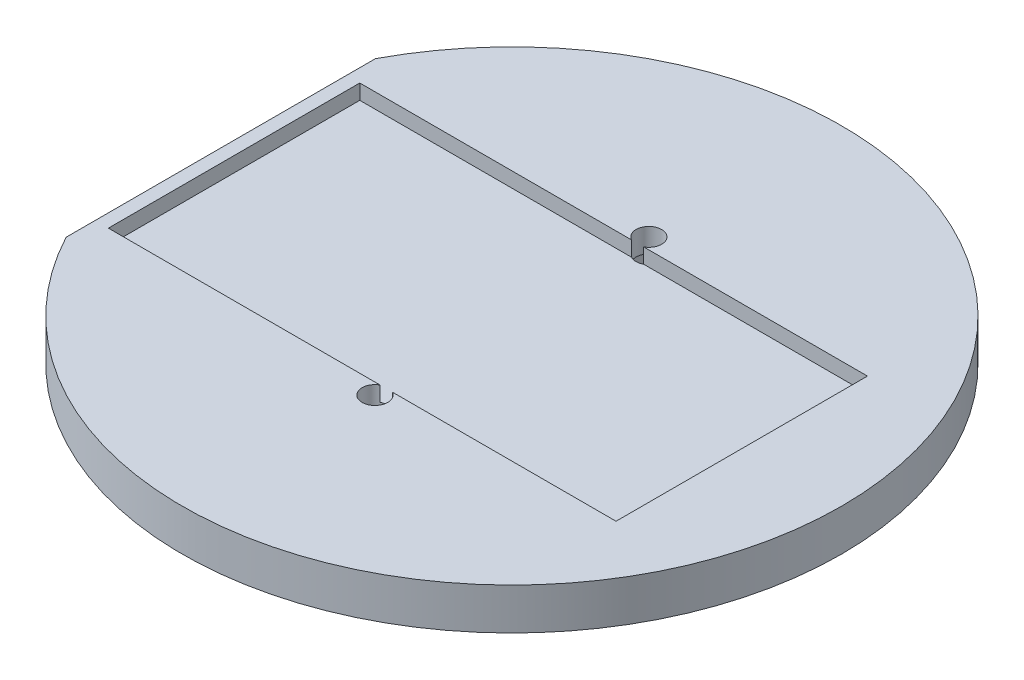
ISO-10303-21;
HEADER;
FILE_DESCRIPTION(('STEP AP214'),'2;1');
FILE_NAME('part.step','',(''),(''),'','','');
FILE_SCHEMA(('AUTOMOTIVE_DESIGN { 1 0 10303 214 1 1 1 1 }'));
ENDSEC;
DATA;
#1=APPLICATION_CONTEXT('core data for automotive mechanical design processes');
#2=APPLICATION_PROTOCOL_DEFINITION('international standard','automotive_design',2000,#1);
#3=PRODUCT_CONTEXT('',#1,'mechanical');
#4=PRODUCT('Part','Part','',(#3));
#5=PRODUCT_RELATED_PRODUCT_CATEGORY('part','',(#4));
#6=PRODUCT_DEFINITION_FORMATION('','',#4);
#7=PRODUCT_DEFINITION_CONTEXT('part definition',#1,'design');
#8=PRODUCT_DEFINITION('design','',#6,#7);
#9=PRODUCT_DEFINITION_SHAPE('','',#8);
#10=(LENGTH_UNIT() NAMED_UNIT(*) SI_UNIT(.MILLI.,.METRE.));
#11=(NAMED_UNIT(*) PLANE_ANGLE_UNIT() SI_UNIT($,.RADIAN.));
#12=(NAMED_UNIT(*) SI_UNIT($,.STERADIAN.) SOLID_ANGLE_UNIT());
#13=UNCERTAINTY_MEASURE_WITH_UNIT(LENGTH_MEASURE(1.E-05),#10,'distance_accuracy_value','');
#14=(GEOMETRIC_REPRESENTATION_CONTEXT(3) GLOBAL_UNCERTAINTY_ASSIGNED_CONTEXT((#13)) GLOBAL_UNIT_ASSIGNED_CONTEXT((#10,
#11,#12)) REPRESENTATION_CONTEXT('',''));
#15=CARTESIAN_POINT('',(0.,0.,0.));
#16=DIRECTION('',(0.,0.,1.));
#17=DIRECTION('',(1.,0.,0.));
#18=AXIS2_PLACEMENT_3D('',#15,#16,#17);
#19=CARTESIAN_POINT('',(0.,0.,0.));
#20=DIRECTION('',(0.,1.,0.));
#21=DIRECTION('',(0.,0.,1.));
#22=AXIS2_PLACEMENT_3D('',#19,#20,#21);
#23=PLANE('',#22);
#24=DIRECTION('',(0.,0.,1.));
#25=VECTOR('',#24,1.);
#26=CARTESIAN_POINT('',(-32.9399453551459,0.,0.));
#27=LINE('',#26,#25);
#28=CARTESIAN_POINT('',(-32.9399453551459,0.,-17.5));
#29=VERTEX_POINT('',#28);
#30=CARTESIAN_POINT('',(-32.9399453551459,0.,17.5));
#31=VERTEX_POINT('',#30);
#32=EDGE_CURVE('E414',#29,#31,#27,.T.);
#33=ORIENTED_EDGE('',*,*,#32,.F.);
#34=CARTESIAN_POINT('',(0.,0.,0.));
#35=DIRECTION('',(0.,1.,0.));
#36=DIRECTION('',(0.,0.,1.));
#37=AXIS2_PLACEMENT_3D('',#34,#35,#36);
#38=CIRCLE('',#37,37.3);
#39=EDGE_CURVE('E418',#31,#29,#38,.T.);
#40=ORIENTED_EDGE('',*,*,#39,.F.);
#41=EDGE_LOOP('',(#33,#40));
#42=FACE_BOUND('',#41,.T.);
#43=DIRECTION('',(-0.5,0.,0.866025403784438));
#44=VECTOR('',#43,1.);
#45=CARTESIAN_POINT('',(2.88675134594813,0.,-15.5));
#46=LINE('',#45,#44);
#47=CARTESIAN_POINT('',(2.88675134594813,0.,-15.5));
#48=VERTEX_POINT('',#47);
#49=CARTESIAN_POINT('',(1.44337567297406,0.,-13.));
#50=VERTEX_POINT('',#49);
#51=EDGE_CURVE('E311',#48,#50,#46,.T.);
#52=ORIENTED_EDGE('',*,*,#51,.F.);
#53=DIRECTION('',(0.5,0.,0.866025403784439));
#54=VECTOR('',#53,1.);
#55=CARTESIAN_POINT('',(1.44337567297407,0.,-18.));
#56=LINE('',#55,#54);
#57=CARTESIAN_POINT('',(1.44337567297407,0.,-18.));
#58=VERTEX_POINT('',#57);
#59=EDGE_CURVE('E282',#58,#48,#56,.T.);
#60=ORIENTED_EDGE('',*,*,#59,.F.);
#61=DIRECTION('',(1.,0.,0.));
#62=VECTOR('',#61,1.);
#63=CARTESIAN_POINT('',(-1.44337567297406,0.,-18.));
#64=LINE('',#63,#62);
#65=CARTESIAN_POINT('',(-1.44337567297406,0.,-18.));
#66=VERTEX_POINT('',#65);
#67=EDGE_CURVE('E288',#66,#58,#64,.T.);
#68=ORIENTED_EDGE('',*,*,#67,.F.);
#69=DIRECTION('',(0.5,0.,-0.866025403784439));
#70=VECTOR('',#69,1.);
#71=CARTESIAN_POINT('',(-2.88675134594813,0.,-15.5));
#72=LINE('',#71,#70);
#73=CARTESIAN_POINT('',(-2.88675134594813,0.,-15.5));
#74=VERTEX_POINT('',#73);
#75=EDGE_CURVE('E323',#74,#66,#72,.T.);
#76=ORIENTED_EDGE('',*,*,#75,.F.);
#77=DIRECTION('',(-0.5,0.,-0.866025403784439));
#78=VECTOR('',#77,1.);
#79=CARTESIAN_POINT('',(-1.44337567297406,0.,-13.));
#80=LINE('',#79,#78);
#81=CARTESIAN_POINT('',(-1.44337567297406,0.,-13.));
#82=VERTEX_POINT('',#81);
#83=EDGE_CURVE('E319',#82,#74,#80,.T.);
#84=ORIENTED_EDGE('',*,*,#83,.F.);
#85=DIRECTION('',(-1.,0.,0.));
#86=VECTOR('',#85,1.);
#87=CARTESIAN_POINT('',(1.44337567297406,0.,-13.));
#88=LINE('',#87,#86);
#89=EDGE_CURVE('E315',#50,#82,#88,.T.);
#90=ORIENTED_EDGE('',*,*,#89,.F.);
#91=EDGE_LOOP('',(#52,#60,#68,#76,#84,#90));
#92=FACE_BOUND('',#91,.T.);
#93=DIRECTION('',(0.5,0.,-0.866025403784439));
#94=VECTOR('',#93,1.);
#95=CARTESIAN_POINT('',(1.44337567297407,0.,18.));
#96=LINE('',#95,#94);
#97=CARTESIAN_POINT('',(1.44337567297407,0.,18.));
#98=VERTEX_POINT('',#97);
#99=CARTESIAN_POINT('',(2.88675134594813,0.,15.5));
#100=VERTEX_POINT('',#99);
#101=EDGE_CURVE('E65',#98,#100,#96,.T.);
#102=ORIENTED_EDGE('',*,*,#101,.T.);
#103=DIRECTION('',(-0.5,0.,-0.866025403784438));
#104=VECTOR('',#103,1.);
#105=CARTESIAN_POINT('',(2.88675134594813,0.,15.5));
#106=LINE('',#105,#104);
#107=CARTESIAN_POINT('',(1.44337567297406,0.,13.));
#108=VERTEX_POINT('',#107);
#109=EDGE_CURVE('E222',#100,#108,#106,.T.);
#110=ORIENTED_EDGE('',*,*,#109,.T.);
#111=DIRECTION('',(-1.,0.,0.));
#112=VECTOR('',#111,1.);
#113=CARTESIAN_POINT('',(1.44337567297406,0.,13.));
#114=LINE('',#113,#112);
#115=CARTESIAN_POINT('',(-1.44337567297406,0.,13.));
#116=VERTEX_POINT('',#115);
#117=EDGE_CURVE('E229',#108,#116,#114,.T.);
#118=ORIENTED_EDGE('',*,*,#117,.T.);
#119=DIRECTION('',(-0.5,0.,0.866025403784439));
#120=VECTOR('',#119,1.);
#121=CARTESIAN_POINT('',(-1.44337567297406,0.,13.));
#122=LINE('',#121,#120);
#123=CARTESIAN_POINT('',(-2.88675134594813,0.,15.5));
#124=VERTEX_POINT('',#123);
#125=EDGE_CURVE('E251',#116,#124,#122,.T.);
#126=ORIENTED_EDGE('',*,*,#125,.T.);
#127=DIRECTION('',(0.5,0.,0.866025403784439));
#128=VECTOR('',#127,1.);
#129=CARTESIAN_POINT('',(-2.88675134594813,0.,15.5));
#130=LINE('',#129,#128);
#131=CARTESIAN_POINT('',(-1.44337567297406,0.,18.));
#132=VERTEX_POINT('',#131);
#133=EDGE_CURVE('E247',#124,#132,#130,.T.);
#134=ORIENTED_EDGE('',*,*,#133,.T.);
#135=DIRECTION('',(1.,0.,0.));
#136=VECTOR('',#135,1.);
#137=CARTESIAN_POINT('',(-1.44337567297406,0.,18.));
#138=LINE('',#137,#136);
#139=EDGE_CURVE('E244',#132,#98,#138,.T.);
#140=ORIENTED_EDGE('',*,*,#139,.T.);
#141=EDGE_LOOP('',(#102,#110,#118,#126,#134,#140));
#142=FACE_BOUND('',#141,.T.);
#143=ADVANCED_FACE('F48',(#42,#92,#142),#23,.F.);
#144=CARTESIAN_POINT('',(0.,0.,15.5));
#145=DIRECTION('',(0.,1.,0.));
#146=DIRECTION('',(0.,0.,1.));
#147=AXIS2_PLACEMENT_3D('',#144,#145,#146);
#148=CYLINDRICAL_SURFACE('',#147,1.45);
#149=CARTESIAN_POINT('',(0.,4.7,15.5));
#150=DIRECTION('',(0.,-1.,0.));
#151=DIRECTION('',(0.,0.,-1.));
#152=AXIS2_PLACEMENT_3D('',#149,#150,#151);
#153=CIRCLE('',#152,1.45);
#154=CARTESIAN_POINT('',(0.690561365846656,4.7,14.225));
#155=VERTEX_POINT('',#154);
#156=CARTESIAN_POINT('',(-0.690561365846656,4.7,14.225));
#157=VERTEX_POINT('',#156);
#158=EDGE_CURVE('E272',#155,#157,#153,.T.);
#159=ORIENTED_EDGE('',*,*,#158,.F.);
#160=DIRECTION('',(0.,1.,0.));
#161=VECTOR('',#160,1.);
#162=CARTESIAN_POINT('',(0.690561365846656,0.,14.225));
#163=LINE('',#162,#161);
#164=CARTESIAN_POINT('',(0.690561365846656,3.,14.225));
#165=VERTEX_POINT('',#164);
#166=EDGE_CURVE('E73',#165,#155,#163,.T.);
#167=ORIENTED_EDGE('',*,*,#166,.F.);
#168=CARTESIAN_POINT('',(0.,3.,15.5));
#169=DIRECTION('',(0.,1.,0.));
#170=DIRECTION('',(0.,0.,1.));
#171=AXIS2_PLACEMENT_3D('',#168,#169,#170);
#172=CIRCLE('',#171,1.45);
#173=CARTESIAN_POINT('',(-0.690561365846656,3.,14.225));
#174=VERTEX_POINT('',#173);
#175=EDGE_CURVE('E11',#174,#165,#172,.F.);
#176=ORIENTED_EDGE('',*,*,#175,.F.);
#177=DIRECTION('',(0.,1.,0.));
#178=VECTOR('',#177,1.);
#179=CARTESIAN_POINT('',(-0.690561365846657,0.,14.225));
#180=LINE('',#179,#178);
#181=EDGE_CURVE('E278',#157,#174,#180,.F.);
#182=ORIENTED_EDGE('',*,*,#181,.F.);
#183=EDGE_LOOP('',(#159,#167,#176,#182));
#184=FACE_BOUND('',#183,.T.);
#185=CARTESIAN_POINT('',(0.,2.,15.5));
#186=DIRECTION('',(0.,-1.,0.));
#187=DIRECTION('',(0.,0.,-1.));
#188=AXIS2_PLACEMENT_3D('',#185,#186,#187);
#189=CIRCLE('',#188,1.45);
#190=CARTESIAN_POINT('',(0.,2.,14.05));
#191=VERTEX_POINT('',#190);
#192=EDGE_CURVE('E52',#191,#191,#189,.T.);
#193=ORIENTED_EDGE('',*,*,#192,.T.);
#194=EDGE_LOOP('',(#193));
#195=FACE_BOUND('',#194,.T.);
#196=ADVANCED_FACE('F457',(#184,#195),#148,.F.);
#197=CARTESIAN_POINT('',(26.0100546448541,4.7,14.225));
#198=DIRECTION('',(0.,0.,-1.));
#199=DIRECTION('',(-1.,0.,0.));
#200=AXIS2_PLACEMENT_3D('',#197,#198,#199);
#201=PLANE('',#200);
#202=DIRECTION('',(1.,0.,0.));
#203=VECTOR('',#202,1.);
#204=CARTESIAN_POINT('',(26.0100546448541,4.7,14.225));
#205=LINE('',#204,#203);
#206=CARTESIAN_POINT('',(-31.4399453551459,4.7,14.225));
#207=VERTEX_POINT('',#206);
#208=EDGE_CURVE('E364',#207,#157,#205,.T.);
#209=ORIENTED_EDGE('',*,*,#208,.T.);
#210=ORIENTED_EDGE('',*,*,#181,.T.);
#211=DIRECTION('',(1.,0.,0.));
#212=VECTOR('',#211,1.);
#213=CARTESIAN_POINT('',(26.0100546448541,3.,14.225));
#214=LINE('',#213,#212);
#215=CARTESIAN_POINT('',(-31.4399453551459,3.,14.225));
#216=VERTEX_POINT('',#215);
#217=EDGE_CURVE('E381',#216,#174,#214,.T.);
#218=ORIENTED_EDGE('',*,*,#217,.F.);
#219=DIRECTION('',(0.,-1.,0.));
#220=VECTOR('',#219,1.);
#221=CARTESIAN_POINT('',(-31.4399453551459,4.7,14.225));
#222=LINE('',#221,#220);
#223=EDGE_CURVE('E402',#207,#216,#222,.T.);
#224=ORIENTED_EDGE('',*,*,#223,.F.);
#225=EDGE_LOOP('',(#209,#210,#218,#224));
#226=FACE_BOUND('',#225,.T.);
#227=ADVANCED_FACE('F452',(#226),#201,.T.);
#228=CARTESIAN_POINT('',(26.0100546448541,3.,14.225));
#229=VERTEX_POINT('',#228);
#230=EDGE_CURVE('E380',#165,#229,#214,.T.);
#231=ORIENTED_EDGE('',*,*,#230,.F.);
#232=ORIENTED_EDGE('',*,*,#166,.T.);
#233=CARTESIAN_POINT('',(26.0100546448541,4.7,14.225));
#234=VERTEX_POINT('',#233);
#235=EDGE_CURVE('E362',#155,#234,#205,.T.);
#236=ORIENTED_EDGE('',*,*,#235,.T.);
#237=DIRECTION('',(0.,-1.,0.));
#238=VECTOR('',#237,1.);
#239=CARTESIAN_POINT('',(26.0100546448541,4.7,14.225));
#240=LINE('',#239,#238);
#241=EDGE_CURVE('E398',#234,#229,#240,.T.);
#242=ORIENTED_EDGE('',*,*,#241,.T.);
#243=EDGE_LOOP('',(#231,#232,#236,#242));
#244=FACE_BOUND('',#243,.T.);
#245=ADVANCED_FACE('F442',(#244),#201,.T.);
#246=CARTESIAN_POINT('',(0.,0.,-15.5));
#247=DIRECTION('',(0.,1.,0.));
#248=DIRECTION('',(0.,0.,1.));
#249=AXIS2_PLACEMENT_3D('',#246,#247,#248);
#250=CYLINDRICAL_SURFACE('',#249,1.45);
#251=DIRECTION('',(0.,1.,0.));
#252=VECTOR('',#251,1.);
#253=CARTESIAN_POINT('',(0.69056136584666,0.,-14.225));
#254=LINE('',#253,#252);
#255=CARTESIAN_POINT('',(0.690561365846659,3.,-14.225));
#256=VERTEX_POINT('',#255);
#257=CARTESIAN_POINT('',(0.690561365846659,4.7,-14.225));
#258=VERTEX_POINT('',#257);
#259=EDGE_CURVE('E355',#256,#258,#254,.T.);
#260=ORIENTED_EDGE('',*,*,#259,.T.);
#261=CARTESIAN_POINT('',(0.,4.7,-15.5));
#262=DIRECTION('',(0.,1.,0.));
#263=DIRECTION('',(0.,0.,1.));
#264=AXIS2_PLACEMENT_3D('',#261,#262,#263);
#265=CIRCLE('',#264,1.45);
#266=CARTESIAN_POINT('',(-0.690561365846659,4.7,-14.225));
#267=VERTEX_POINT('',#266);
#268=EDGE_CURVE('E349',#258,#267,#265,.T.);
#269=ORIENTED_EDGE('',*,*,#268,.T.);
#270=DIRECTION('',(0.,1.,0.));
#271=VECTOR('',#270,1.);
#272=CARTESIAN_POINT('',(-0.690561365846659,0.,-14.225));
#273=LINE('',#272,#271);
#274=CARTESIAN_POINT('',(-0.690561365846659,3.,-14.225));
#275=VERTEX_POINT('',#274);
#276=EDGE_CURVE('E352',#267,#275,#273,.F.);
#277=ORIENTED_EDGE('',*,*,#276,.T.);
#278=CARTESIAN_POINT('',(0.,3.,-15.5));
#279=DIRECTION('',(0.,1.,0.));
#280=DIRECTION('',(0.,0.,1.));
#281=AXIS2_PLACEMENT_3D('',#278,#279,#280);
#282=CIRCLE('',#281,1.45);
#283=EDGE_CURVE('E58',#275,#256,#282,.T.);
#284=ORIENTED_EDGE('',*,*,#283,.T.);
#285=EDGE_LOOP('',(#260,#269,#277,#284));
#286=FACE_BOUND('',#285,.T.);
#287=CARTESIAN_POINT('',(0.,2.,-15.5));
#288=DIRECTION('',(0.,-1.,0.));
#289=DIRECTION('',(0.,0.,-1.));
#290=AXIS2_PLACEMENT_3D('',#287,#288,#289);
#291=CIRCLE('',#290,1.45);
#292=CARTESIAN_POINT('',(0.,2.,-16.95));
#293=VERTEX_POINT('',#292);
#294=EDGE_CURVE('E333',#293,#293,#291,.F.);
#295=ORIENTED_EDGE('',*,*,#294,.F.);
#296=EDGE_LOOP('',(#295));
#297=FACE_BOUND('',#296,.T.);
#298=ADVANCED_FACE('F439',(#286,#297),#250,.F.);
#299=CARTESIAN_POINT('',(26.0100546448541,4.7,-14.225));
#300=DIRECTION('',(0.,0.,1.));
#301=DIRECTION('',(1.,0.,0.));
#302=AXIS2_PLACEMENT_3D('',#299,#300,#301);
#303=PLANE('',#302);
#304=ORIENTED_EDGE('',*,*,#259,.F.);
#305=DIRECTION('',(-1.,0.,0.));
#306=VECTOR('',#305,1.);
#307=CARTESIAN_POINT('',(26.0100546448541,3.,-14.225));
#308=LINE('',#307,#306);
#309=CARTESIAN_POINT('',(26.0100546448541,3.,-14.225));
#310=VERTEX_POINT('',#309);
#311=EDGE_CURVE('E363',#310,#256,#308,.T.);
#312=ORIENTED_EDGE('',*,*,#311,.F.);
#313=DIRECTION('',(0.,-1.,0.));
#314=VECTOR('',#313,1.);
#315=CARTESIAN_POINT('',(26.0100546448541,4.7,-14.225));
#316=LINE('',#315,#314);
#317=CARTESIAN_POINT('',(26.0100546448541,4.7,-14.225));
#318=VERTEX_POINT('',#317);
#319=EDGE_CURVE('E394',#318,#310,#316,.T.);
#320=ORIENTED_EDGE('',*,*,#319,.F.);
#321=DIRECTION('',(-1.,0.,0.));
#322=VECTOR('',#321,1.);
#323=CARTESIAN_POINT('',(26.0100546448541,4.7,-14.225));
#324=LINE('',#323,#322);
#325=EDGE_CURVE('E373',#318,#258,#324,.T.);
#326=ORIENTED_EDGE('',*,*,#325,.T.);
#327=EDGE_LOOP('',(#304,#312,#320,#326));
#328=FACE_BOUND('',#327,.T.);
#329=ADVANCED_FACE('F441',(#328),#303,.T.);
#330=CARTESIAN_POINT('',(-32.9399453551459,3.,0.));
#331=DIRECTION('',(1.,0.,0.));
#332=DIRECTION('',(0.,0.,-1.));
#333=AXIS2_PLACEMENT_3D('',#330,#331,#332);
#334=PLANE('',#333);
#335=ORIENTED_EDGE('',*,*,#32,.T.);
#336=DIRECTION('',(0.,-1.,0.));
#337=VECTOR('',#336,1.);
#338=CARTESIAN_POINT('',(-32.9399453551459,3.,17.5));
#339=LINE('',#338,#337);
#340=CARTESIAN_POINT('',(-32.9399453551459,4.7,17.5));
#341=VERTEX_POINT('',#340);
#342=EDGE_CURVE('E425',#341,#31,#339,.T.);
#343=ORIENTED_EDGE('',*,*,#342,.F.);
#344=DIRECTION('',(0.,0.,1.));
#345=VECTOR('',#344,1.);
#346=CARTESIAN_POINT('',(-32.9399453551459,4.7,-17.5));
#347=LINE('',#346,#345);
#348=CARTESIAN_POINT('',(-32.9399453551459,4.7,-17.5));
#349=VERTEX_POINT('',#348);
#350=EDGE_CURVE('E410',#349,#341,#347,.T.);
#351=ORIENTED_EDGE('',*,*,#350,.F.);
#352=DIRECTION('',(0.,-1.,0.));
#353=VECTOR('',#352,1.);
#354=CARTESIAN_POINT('',(-32.9399453551459,3.,-17.5));
#355=LINE('',#354,#353);
#356=EDGE_CURVE('E421',#349,#29,#355,.T.);
#357=ORIENTED_EDGE('',*,*,#356,.T.);
#358=EDGE_LOOP('',(#335,#343,#351,#357));
#359=FACE_BOUND('',#358,.T.);
#360=ADVANCED_FACE('F50',(#359),#334,.F.);
#361=CARTESIAN_POINT('',(0.,3.,0.));
#362=DIRECTION('',(0.,-1.,0.));
#363=DIRECTION('',(0.,0.,-1.));
#364=AXIS2_PLACEMENT_3D('',#361,#362,#363);
#365=CYLINDRICAL_SURFACE('',#364,37.3);
#366=ORIENTED_EDGE('',*,*,#39,.T.);
#367=ORIENTED_EDGE('',*,*,#356,.F.);
#368=CARTESIAN_POINT('',(0.,4.7,0.));
#369=DIRECTION('',(0.,1.,0.));
#370=DIRECTION('',(0.,0.,1.));
#371=AXIS2_PLACEMENT_3D('',#368,#369,#370);
#372=CIRCLE('',#371,37.3);
#373=EDGE_CURVE('E406',#341,#349,#372,.T.);
#374=ORIENTED_EDGE('',*,*,#373,.F.);
#375=ORIENTED_EDGE('',*,*,#342,.T.);
#376=EDGE_LOOP('',(#366,#367,#374,#375));
#377=FACE_BOUND('',#376,.T.);
#378=ADVANCED_FACE('F469',(#377),#365,.T.);
#379=CARTESIAN_POINT('',(0.,4.7,0.));
#380=DIRECTION('',(0.,1.,0.));
#381=DIRECTION('',(0.,0.,1.));
#382=AXIS2_PLACEMENT_3D('',#379,#380,#381);
#383=PLANE('',#382);
#384=ORIENTED_EDGE('',*,*,#235,.F.);
#385=ORIENTED_EDGE('',*,*,#158,.T.);
#386=ORIENTED_EDGE('',*,*,#208,.F.);
#387=DIRECTION('',(0.,0.,1.));
#388=VECTOR('',#387,1.);
#389=CARTESIAN_POINT('',(-31.4399453551459,4.7,14.225));
#390=LINE('',#389,#388);
#391=CARTESIAN_POINT('',(-31.4399453551459,4.7,-14.225));
#392=VERTEX_POINT('',#391);
#393=EDGE_CURVE('E359',#392,#207,#390,.T.);
#394=ORIENTED_EDGE('',*,*,#393,.F.);
#395=EDGE_CURVE('E372',#267,#392,#324,.T.);
#396=ORIENTED_EDGE('',*,*,#395,.F.);
#397=ORIENTED_EDGE('',*,*,#268,.F.);
#398=ORIENTED_EDGE('',*,*,#325,.F.);
#399=DIRECTION('',(0.,0.,-1.));
#400=VECTOR('',#399,1.);
#401=CARTESIAN_POINT('',(26.0100546448541,4.7,14.225));
#402=LINE('',#401,#400);
#403=EDGE_CURVE('E368',#234,#318,#402,.T.);
#404=ORIENTED_EDGE('',*,*,#403,.F.);
#405=EDGE_LOOP('',(#384,#385,#386,#394,#396,#397,#398,#404));
#406=FACE_BOUND('',#405,.T.);
#407=ORIENTED_EDGE('',*,*,#373,.T.);
#408=ORIENTED_EDGE('',*,*,#350,.T.);
#409=EDGE_LOOP('',(#407,#408));
#410=FACE_BOUND('',#409,.T.);
#411=ADVANCED_FACE('F471',(#406,#410),#383,.T.);
#412=CARTESIAN_POINT('',(-31.4399453551459,4.7,14.225));
#413=DIRECTION('',(1.,0.,0.));
#414=DIRECTION('',(0.,0.,-1.));
#415=AXIS2_PLACEMENT_3D('',#412,#413,#414);
#416=PLANE('',#415);
#417=DIRECTION('',(0.,0.,1.));
#418=VECTOR('',#417,1.);
#419=CARTESIAN_POINT('',(-31.4399453551459,3.,14.225));
#420=LINE('',#419,#418);
#421=CARTESIAN_POINT('',(-31.4399453551459,3.,-14.225));
#422=VERTEX_POINT('',#421);
#423=EDGE_CURVE('E358',#422,#216,#420,.T.);
#424=ORIENTED_EDGE('',*,*,#423,.F.);
#425=DIRECTION('',(0.,-1.,0.));
#426=VECTOR('',#425,1.);
#427=CARTESIAN_POINT('',(-31.4399453551459,4.7,-14.225));
#428=LINE('',#427,#426);
#429=EDGE_CURVE('E377',#392,#422,#428,.T.);
#430=ORIENTED_EDGE('',*,*,#429,.F.);
#431=ORIENTED_EDGE('',*,*,#393,.T.);
#432=ORIENTED_EDGE('',*,*,#223,.T.);
#433=EDGE_LOOP('',(#424,#430,#431,#432));
#434=FACE_BOUND('',#433,.T.);
#435=ADVANCED_FACE('F477',(#434),#416,.T.);
#436=CARTESIAN_POINT('',(26.0100546448541,4.7,14.225));
#437=DIRECTION('',(-1.,0.,0.));
#438=DIRECTION('',(0.,0.,1.));
#439=AXIS2_PLACEMENT_3D('',#436,#437,#438);
#440=PLANE('',#439);
#441=DIRECTION('',(0.,0.,-1.));
#442=VECTOR('',#441,1.);
#443=CARTESIAN_POINT('',(26.0100546448541,3.,14.225));
#444=LINE('',#443,#442);
#445=EDGE_CURVE('E385',#229,#310,#444,.T.);
#446=ORIENTED_EDGE('',*,*,#445,.F.);
#447=ORIENTED_EDGE('',*,*,#241,.F.);
#448=ORIENTED_EDGE('',*,*,#403,.T.);
#449=ORIENTED_EDGE('',*,*,#319,.T.);
#450=EDGE_LOOP('',(#446,#447,#448,#449));
#451=FACE_BOUND('',#450,.T.);
#452=ADVANCED_FACE('F610',(#451),#440,.T.);
#453=ORIENTED_EDGE('',*,*,#276,.F.);
#454=ORIENTED_EDGE('',*,*,#395,.T.);
#455=ORIENTED_EDGE('',*,*,#429,.T.);
#456=EDGE_CURVE('E388',#275,#422,#308,.T.);
#457=ORIENTED_EDGE('',*,*,#456,.F.);
#458=EDGE_LOOP('',(#453,#454,#455,#457));
#459=FACE_BOUND('',#458,.T.);
#460=ADVANCED_FACE('F451',(#459),#303,.T.);
#461=CARTESIAN_POINT('',(0.,3.,0.));
#462=DIRECTION('',(0.,1.,0.));
#463=DIRECTION('',(0.,0.,1.));
#464=AXIS2_PLACEMENT_3D('',#461,#462,#463);
#465=PLANE('',#464);
#466=ORIENTED_EDGE('',*,*,#217,.T.);
#467=ORIENTED_EDGE('',*,*,#175,.T.);
#468=ORIENTED_EDGE('',*,*,#230,.T.);
#469=ORIENTED_EDGE('',*,*,#445,.T.);
#470=ORIENTED_EDGE('',*,*,#311,.T.);
#471=ORIENTED_EDGE('',*,*,#283,.F.);
#472=ORIENTED_EDGE('',*,*,#456,.T.);
#473=ORIENTED_EDGE('',*,*,#423,.T.);
#474=EDGE_LOOP('',(#466,#467,#468,#469,#470,#471,#472,#473));
#475=FACE_BOUND('',#474,.T.);
#476=ADVANCED_FACE('F467',(#475),#465,.T.);
#477=CARTESIAN_POINT('',(0.,2.,0.));
#478=DIRECTION('',(0.,-1.,0.));
#479=DIRECTION('',(0.,0.,-1.));
#480=AXIS2_PLACEMENT_3D('',#477,#478,#479);
#481=PLANE('',#480);
#482=DIRECTION('',(0.5,0.,0.866025403784439));
#483=VECTOR('',#482,1.);
#484=CARTESIAN_POINT('',(1.44337567297407,2.,-18.));
#485=LINE('',#484,#483);
#486=CARTESIAN_POINT('',(1.44337567297407,2.,-18.));
#487=VERTEX_POINT('',#486);
#488=CARTESIAN_POINT('',(2.88675134594813,2.,-15.5));
#489=VERTEX_POINT('',#488);
#490=EDGE_CURVE('E283',#487,#489,#485,.T.);
#491=ORIENTED_EDGE('',*,*,#490,.T.);
#492=DIRECTION('',(-0.5,0.,0.866025403784438));
#493=VECTOR('',#492,1.);
#494=CARTESIAN_POINT('',(2.88675134594813,2.,-15.5));
#495=LINE('',#494,#493);
#496=CARTESIAN_POINT('',(1.44337567297406,2.,-13.));
#497=VERTEX_POINT('',#496);
#498=EDGE_CURVE('E287',#489,#497,#495,.T.);
#499=ORIENTED_EDGE('',*,*,#498,.T.);
#500=DIRECTION('',(-1.,0.,0.));
#501=VECTOR('',#500,1.);
#502=CARTESIAN_POINT('',(1.44337567297406,2.,-13.));
#503=LINE('',#502,#501);
#504=CARTESIAN_POINT('',(-1.44337567297406,2.,-13.));
#505=VERTEX_POINT('',#504);
#506=EDGE_CURVE('E292',#497,#505,#503,.T.);
#507=ORIENTED_EDGE('',*,*,#506,.T.);
#508=DIRECTION('',(-0.5,0.,-0.866025403784439));
#509=VECTOR('',#508,1.);
#510=CARTESIAN_POINT('',(-1.44337567297406,2.,-13.));
#511=LINE('',#510,#509);
#512=CARTESIAN_POINT('',(-2.88675134594813,2.,-15.5));
#513=VERTEX_POINT('',#512);
#514=EDGE_CURVE('E296',#505,#513,#511,.T.);
#515=ORIENTED_EDGE('',*,*,#514,.T.);
#516=DIRECTION('',(0.5,0.,-0.866025403784439));
#517=VECTOR('',#516,1.);
#518=CARTESIAN_POINT('',(-2.88675134594813,2.,-15.5));
#519=LINE('',#518,#517);
#520=CARTESIAN_POINT('',(-1.44337567297406,2.,-18.));
#521=VERTEX_POINT('',#520);
#522=EDGE_CURVE('E300',#513,#521,#519,.T.);
#523=ORIENTED_EDGE('',*,*,#522,.T.);
#524=DIRECTION('',(1.,0.,0.));
#525=VECTOR('',#524,1.);
#526=CARTESIAN_POINT('',(-1.44337567297406,2.,-18.));
#527=LINE('',#526,#525);
#528=EDGE_CURVE('E304',#521,#487,#527,.T.);
#529=ORIENTED_EDGE('',*,*,#528,.T.);
#530=EDGE_LOOP('',(#491,#499,#507,#515,#523,#529));
#531=FACE_BOUND('',#530,.T.);
#532=ORIENTED_EDGE('',*,*,#294,.T.);
#533=EDGE_LOOP('',(#532));
#534=FACE_BOUND('',#533,.T.);
#535=ADVANCED_FACE('F437',(#531,#534),#481,.T.);
#536=CARTESIAN_POINT('',(1.44337567297407,2.,-18.));
#537=DIRECTION('',(0.866025403784439,0.,-0.5));
#538=DIRECTION('',(-0.5,0.,-0.866025403784439));
#539=AXIS2_PLACEMENT_3D('',#536,#537,#538);
#540=PLANE('',#539);
#541=ORIENTED_EDGE('',*,*,#59,.T.);
#542=DIRECTION('',(0.,-1.,0.));
#543=VECTOR('',#542,1.);
#544=CARTESIAN_POINT('',(2.88675134594813,2.,-15.5));
#545=LINE('',#544,#543);
#546=EDGE_CURVE('E308',#489,#48,#545,.T.);
#547=ORIENTED_EDGE('',*,*,#546,.F.);
#548=ORIENTED_EDGE('',*,*,#490,.F.);
#549=DIRECTION('',(0.,-1.,0.));
#550=VECTOR('',#549,1.);
#551=CARTESIAN_POINT('',(1.44337567297407,2.,-18.));
#552=LINE('',#551,#550);
#553=EDGE_CURVE('E330',#487,#58,#552,.T.);
#554=ORIENTED_EDGE('',*,*,#553,.T.);
#555=EDGE_LOOP('',(#541,#547,#548,#554));
#556=FACE_BOUND('',#555,.T.);
#557=ADVANCED_FACE('F574',(#556),#540,.F.);
#558=CARTESIAN_POINT('',(-1.44337567297406,2.,-18.));
#559=DIRECTION('',(0.,0.,-1.));
#560=DIRECTION('',(-1.,0.,0.));
#561=AXIS2_PLACEMENT_3D('',#558,#559,#560);
#562=PLANE('',#561);
#563=ORIENTED_EDGE('',*,*,#67,.T.);
#564=ORIENTED_EDGE('',*,*,#553,.F.);
#565=ORIENTED_EDGE('',*,*,#528,.F.);
#566=DIRECTION('',(0.,-1.,0.));
#567=VECTOR('',#566,1.);
#568=CARTESIAN_POINT('',(-1.44337567297406,2.,-18.));
#569=LINE('',#568,#567);
#570=EDGE_CURVE('E334',#521,#66,#569,.T.);
#571=ORIENTED_EDGE('',*,*,#570,.T.);
#572=EDGE_LOOP('',(#563,#564,#565,#571));
#573=FACE_BOUND('',#572,.T.);
#574=ADVANCED_FACE('F563',(#573),#562,.F.);
#575=CARTESIAN_POINT('',(-2.88675134594813,2.,-15.5));
#576=DIRECTION('',(-0.866025403784439,0.,-0.5));
#577=DIRECTION('',(-0.5,0.,0.866025403784439));
#578=AXIS2_PLACEMENT_3D('',#575,#576,#577);
#579=PLANE('',#578);
#580=ORIENTED_EDGE('',*,*,#75,.T.);
#581=ORIENTED_EDGE('',*,*,#570,.F.);
#582=ORIENTED_EDGE('',*,*,#522,.F.);
#583=DIRECTION('',(0.,-1.,0.));
#584=VECTOR('',#583,1.);
#585=CARTESIAN_POINT('',(-2.88675134594813,2.,-15.5));
#586=LINE('',#585,#584);
#587=EDGE_CURVE('E337',#513,#74,#586,.T.);
#588=ORIENTED_EDGE('',*,*,#587,.T.);
#589=EDGE_LOOP('',(#580,#581,#582,#588));
#590=FACE_BOUND('',#589,.T.);
#591=ADVANCED_FACE('F552',(#590),#579,.F.);
#592=CARTESIAN_POINT('',(-1.44337567297406,2.,-13.));
#593=DIRECTION('',(-0.866025403784439,0.,0.5));
#594=DIRECTION('',(0.5,0.,0.866025403784439));
#595=AXIS2_PLACEMENT_3D('',#592,#593,#594);
#596=PLANE('',#595);
#597=ORIENTED_EDGE('',*,*,#83,.T.);
#598=ORIENTED_EDGE('',*,*,#587,.F.);
#599=ORIENTED_EDGE('',*,*,#514,.F.);
#600=DIRECTION('',(0.,-1.,0.));
#601=VECTOR('',#600,1.);
#602=CARTESIAN_POINT('',(-1.44337567297406,2.,-13.));
#603=LINE('',#602,#601);
#604=EDGE_CURVE('E340',#505,#82,#603,.T.);
#605=ORIENTED_EDGE('',*,*,#604,.T.);
#606=EDGE_LOOP('',(#597,#598,#599,#605));
#607=FACE_BOUND('',#606,.T.);
#608=ADVANCED_FACE('F541',(#607),#596,.F.);
#609=CARTESIAN_POINT('',(1.44337567297406,2.,-13.));
#610=DIRECTION('',(0.,0.,1.));
#611=DIRECTION('',(1.,0.,0.));
#612=AXIS2_PLACEMENT_3D('',#609,#610,#611);
#613=PLANE('',#612);
#614=ORIENTED_EDGE('',*,*,#89,.T.);
#615=ORIENTED_EDGE('',*,*,#604,.F.);
#616=ORIENTED_EDGE('',*,*,#506,.F.);
#617=DIRECTION('',(0.,-1.,0.));
#618=VECTOR('',#617,1.);
#619=CARTESIAN_POINT('',(1.44337567297406,2.,-13.));
#620=LINE('',#619,#618);
#621=EDGE_CURVE('E343',#497,#50,#620,.T.);
#622=ORIENTED_EDGE('',*,*,#621,.T.);
#623=EDGE_LOOP('',(#614,#615,#616,#622));
#624=FACE_BOUND('',#623,.T.);
#625=ADVANCED_FACE('F528',(#624),#613,.F.);
#626=CARTESIAN_POINT('',(2.88675134594813,2.,-15.5));
#627=DIRECTION('',(0.866025403784438,0.,0.5));
#628=DIRECTION('',(0.5,0.,-0.866025403784438));
#629=AXIS2_PLACEMENT_3D('',#626,#627,#628);
#630=PLANE('',#629);
#631=ORIENTED_EDGE('',*,*,#51,.T.);
#632=ORIENTED_EDGE('',*,*,#621,.F.);
#633=ORIENTED_EDGE('',*,*,#498,.F.);
#634=ORIENTED_EDGE('',*,*,#546,.T.);
#635=EDGE_LOOP('',(#631,#632,#633,#634));
#636=FACE_BOUND('',#635,.T.);
#637=ADVANCED_FACE('F522',(#636),#630,.F.);
#638=CARTESIAN_POINT('',(1.44337567297407,2.,18.));
#639=DIRECTION('',(-0.866025403784439,0.,-0.5));
#640=DIRECTION('',(-0.5,0.,0.866025403784439));
#641=AXIS2_PLACEMENT_3D('',#638,#639,#640);
#642=PLANE('',#641);
#643=ORIENTED_EDGE('',*,*,#101,.F.);
#644=DIRECTION('',(0.,-1.,0.));
#645=VECTOR('',#644,1.);
#646=CARTESIAN_POINT('',(1.44337567297407,2.,18.));
#647=LINE('',#646,#645);
#648=CARTESIAN_POINT('',(1.44337567297407,2.,18.));
#649=VERTEX_POINT('',#648);
#650=EDGE_CURVE('E203',#649,#98,#647,.T.);
#651=ORIENTED_EDGE('',*,*,#650,.F.);
#652=DIRECTION('',(0.5,0.,-0.866025403784439));
#653=VECTOR('',#652,1.);
#654=CARTESIAN_POINT('',(1.44337567297407,2.,18.));
#655=LINE('',#654,#653);
#656=CARTESIAN_POINT('',(2.88675134594813,2.,15.5));
#657=VERTEX_POINT('',#656);
#658=EDGE_CURVE('E211',#649,#657,#655,.T.);
#659=ORIENTED_EDGE('',*,*,#658,.T.);
#660=DIRECTION('',(0.,-1.,0.));
#661=VECTOR('',#660,1.);
#662=CARTESIAN_POINT('',(2.88675134594813,2.,15.5));
#663=LINE('',#662,#661);
#664=EDGE_CURVE('E258',#657,#100,#663,.T.);
#665=ORIENTED_EDGE('',*,*,#664,.T.);
#666=EDGE_LOOP('',(#643,#651,#659,#665));
#667=FACE_BOUND('',#666,.T.);
#668=ADVANCED_FACE('F214',(#667),#642,.T.);
#669=CARTESIAN_POINT('',(2.88675134594813,2.,15.5));
#670=DIRECTION('',(-0.866025403784438,0.,0.5));
#671=DIRECTION('',(0.5,0.,0.866025403784438));
#672=AXIS2_PLACEMENT_3D('',#669,#670,#671);
#673=PLANE('',#672);
#674=ORIENTED_EDGE('',*,*,#109,.F.);
#675=ORIENTED_EDGE('',*,*,#664,.F.);
#676=DIRECTION('',(-0.5,0.,-0.866025403784438));
#677=VECTOR('',#676,1.);
#678=CARTESIAN_POINT('',(2.88675134594813,2.,15.5));
#679=LINE('',#678,#677);
#680=CARTESIAN_POINT('',(1.44337567297406,2.,13.));
#681=VERTEX_POINT('',#680);
#682=EDGE_CURVE('E217',#657,#681,#679,.T.);
#683=ORIENTED_EDGE('',*,*,#682,.T.);
#684=DIRECTION('',(0.,-1.,0.));
#685=VECTOR('',#684,1.);
#686=CARTESIAN_POINT('',(1.44337567297406,2.,13.));
#687=LINE('',#686,#685);
#688=EDGE_CURVE('E261',#681,#108,#687,.T.);
#689=ORIENTED_EDGE('',*,*,#688,.T.);
#690=EDGE_LOOP('',(#674,#675,#683,#689));
#691=FACE_BOUND('',#690,.T.);
#692=ADVANCED_FACE('F704',(#691),#673,.T.);
#693=CARTESIAN_POINT('',(1.44337567297406,2.,13.));
#694=DIRECTION('',(0.,0.,1.));
#695=DIRECTION('',(1.,0.,0.));
#696=AXIS2_PLACEMENT_3D('',#693,#694,#695);
#697=PLANE('',#696);
#698=ORIENTED_EDGE('',*,*,#117,.F.);
#699=ORIENTED_EDGE('',*,*,#688,.F.);
#700=DIRECTION('',(-1.,0.,0.));
#701=VECTOR('',#700,1.);
#702=CARTESIAN_POINT('',(1.44337567297406,2.,13.));
#703=LINE('',#702,#701);
#704=CARTESIAN_POINT('',(-1.44337567297406,2.,13.));
#705=VERTEX_POINT('',#704);
#706=EDGE_CURVE('E237',#681,#705,#703,.T.);
#707=ORIENTED_EDGE('',*,*,#706,.T.);
#708=DIRECTION('',(0.,-1.,0.));
#709=VECTOR('',#708,1.);
#710=CARTESIAN_POINT('',(-1.44337567297406,2.,13.));
#711=LINE('',#710,#709);
#712=EDGE_CURVE('E264',#705,#116,#711,.T.);
#713=ORIENTED_EDGE('',*,*,#712,.T.);
#714=EDGE_LOOP('',(#698,#699,#707,#713));
#715=FACE_BOUND('',#714,.T.);
#716=ADVANCED_FACE('F714',(#715),#697,.T.);
#717=CARTESIAN_POINT('',(-1.44337567297406,2.,13.));
#718=DIRECTION('',(0.866025403784439,0.,0.5));
#719=DIRECTION('',(0.5,0.,-0.866025403784439));
#720=AXIS2_PLACEMENT_3D('',#717,#718,#719);
#721=PLANE('',#720);
#722=ORIENTED_EDGE('',*,*,#125,.F.);
#723=ORIENTED_EDGE('',*,*,#712,.F.);
#724=DIRECTION('',(-0.5,0.,0.866025403784439));
#725=VECTOR('',#724,1.);
#726=CARTESIAN_POINT('',(-1.44337567297406,2.,13.));
#727=LINE('',#726,#725);
#728=CARTESIAN_POINT('',(-2.88675134594813,2.,15.5));
#729=VERTEX_POINT('',#728);
#730=EDGE_CURVE('E234',#705,#729,#727,.T.);
#731=ORIENTED_EDGE('',*,*,#730,.T.);
#732=DIRECTION('',(0.,-1.,0.));
#733=VECTOR('',#732,1.);
#734=CARTESIAN_POINT('',(-2.88675134594813,2.,15.5));
#735=LINE('',#734,#733);
#736=EDGE_CURVE('E267',#729,#124,#735,.T.);
#737=ORIENTED_EDGE('',*,*,#736,.T.);
#738=EDGE_LOOP('',(#722,#723,#731,#737));
#739=FACE_BOUND('',#738,.T.);
#740=ADVANCED_FACE('F726',(#739),#721,.T.);
#741=CARTESIAN_POINT('',(-2.88675134594813,2.,15.5));
#742=DIRECTION('',(0.866025403784439,0.,-0.5));
#743=DIRECTION('',(-0.5,0.,-0.866025403784439));
#744=AXIS2_PLACEMENT_3D('',#741,#742,#743);
#745=PLANE('',#744);
#746=ORIENTED_EDGE('',*,*,#133,.F.);
#747=ORIENTED_EDGE('',*,*,#736,.F.);
#748=DIRECTION('',(0.5,0.,0.866025403784439));
#749=VECTOR('',#748,1.);
#750=CARTESIAN_POINT('',(-2.88675134594813,2.,15.5));
#751=LINE('',#750,#749);
#752=CARTESIAN_POINT('',(-1.44337567297406,2.,18.));
#753=VERTEX_POINT('',#752);
#754=EDGE_CURVE('E210',#729,#753,#751,.T.);
#755=ORIENTED_EDGE('',*,*,#754,.T.);
#756=DIRECTION('',(0.,-1.,0.));
#757=VECTOR('',#756,1.);
#758=CARTESIAN_POINT('',(-1.44337567297406,2.,18.));
#759=LINE('',#758,#757);
#760=EDGE_CURVE('E205',#753,#132,#759,.T.);
#761=ORIENTED_EDGE('',*,*,#760,.T.);
#762=EDGE_LOOP('',(#746,#747,#755,#761));
#763=FACE_BOUND('',#762,.T.);
#764=ADVANCED_FACE('F738',(#763),#745,.T.);
#765=CARTESIAN_POINT('',(-1.44337567297406,2.,18.));
#766=DIRECTION('',(0.,0.,-1.));
#767=DIRECTION('',(-1.,0.,0.));
#768=AXIS2_PLACEMENT_3D('',#765,#766,#767);
#769=PLANE('',#768);
#770=ORIENTED_EDGE('',*,*,#139,.F.);
#771=ORIENTED_EDGE('',*,*,#760,.F.);
#772=DIRECTION('',(1.,0.,0.));
#773=VECTOR('',#772,1.);
#774=CARTESIAN_POINT('',(-1.44337567297406,2.,18.));
#775=LINE('',#774,#773);
#776=EDGE_CURVE('E200',#753,#649,#775,.T.);
#777=ORIENTED_EDGE('',*,*,#776,.T.);
#778=ORIENTED_EDGE('',*,*,#650,.T.);
#779=EDGE_LOOP('',(#770,#771,#777,#778));
#780=FACE_BOUND('',#779,.T.);
#781=ADVANCED_FACE('F202',(#780),#769,.T.);
#782=CARTESIAN_POINT('',(0.,2.,0.));
#783=DIRECTION('',(0.,-1.,0.));
#784=DIRECTION('',(0.,0.,1.));
#785=AXIS2_PLACEMENT_3D('',#782,#783,#784);
#786=PLANE('',#785);
#787=ORIENTED_EDGE('',*,*,#192,.F.);
#788=EDGE_LOOP('',(#787));
#789=FACE_BOUND('',#788,.T.);
#790=ORIENTED_EDGE('',*,*,#658,.F.);
#791=ORIENTED_EDGE('',*,*,#776,.F.);
#792=ORIENTED_EDGE('',*,*,#754,.F.);
#793=ORIENTED_EDGE('',*,*,#730,.F.);
#794=ORIENTED_EDGE('',*,*,#706,.F.);
#795=ORIENTED_EDGE('',*,*,#682,.F.);
#796=EDGE_LOOP('',(#790,#791,#792,#793,#794,#795));
#797=FACE_BOUND('',#796,.T.);
#798=ADVANCED_FACE('F219',(#789,#797),#786,.T.);
#799=CLOSED_SHELL('',(#143,#196,#227,#245,#298,#329,#360,#378,#411,#435,#452,#460,#476,#535,
#557,#574,#591,#608,#625,#637,#668,#692,#716,#740,#764,#781,#798));
#800=MANIFOLD_SOLID_BREP('B2',#799);
#801=ADVANCED_BREP_SHAPE_REPRESENTATION('',(#18,#800),#14);
#802=SHAPE_DEFINITION_REPRESENTATION(#9,#801);
ENDSEC;
END-ISO-10303-21;
